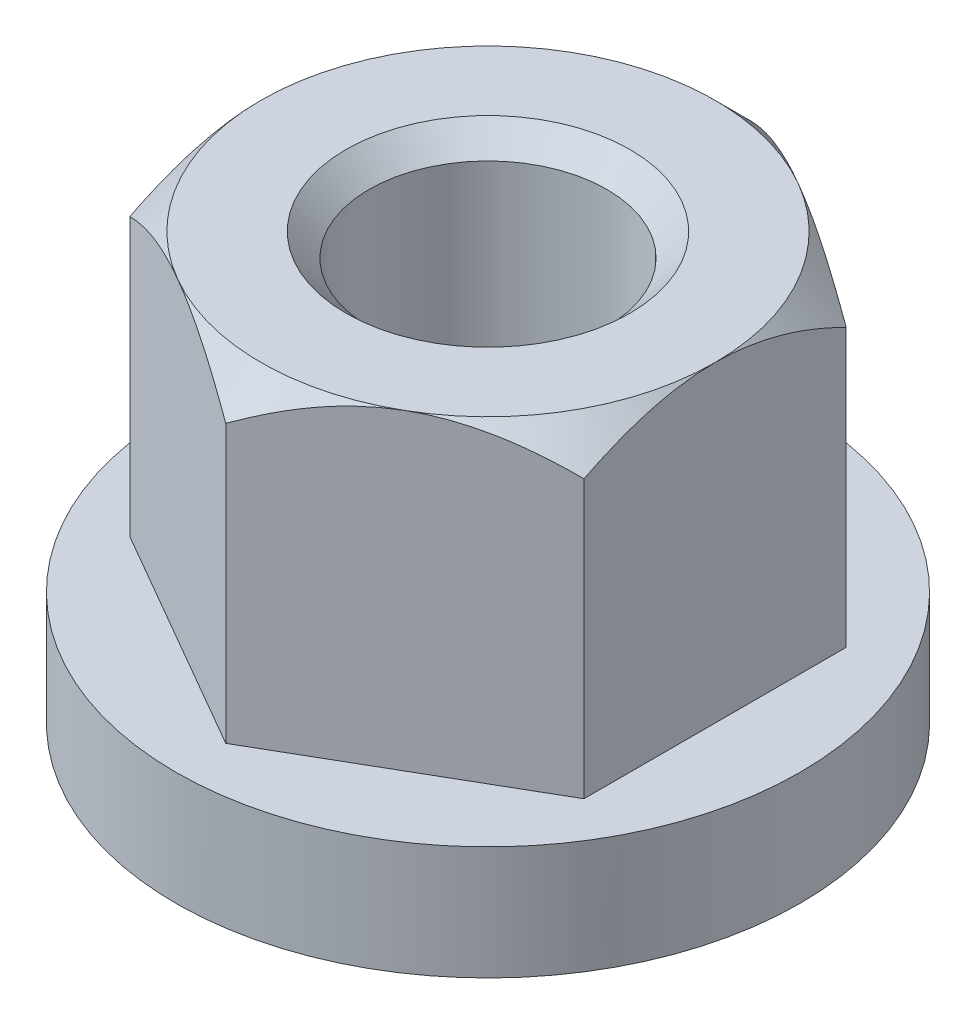
ISO-10303-21;
HEADER;
FILE_DESCRIPTION(('STEP AP214'),'2;1');
FILE_NAME('part.step','',(''),(''),'','','');
FILE_SCHEMA(('AUTOMOTIVE_DESIGN { 1 0 10303 214 1 1 1 1 }'));
ENDSEC;
DATA;
#1=APPLICATION_CONTEXT('core data for automotive mechanical design processes');
#2=APPLICATION_PROTOCOL_DEFINITION('international standard','automotive_design',2000,#1);
#3=PRODUCT_CONTEXT('',#1,'mechanical');
#4=PRODUCT('Part','Part','',(#3));
#5=PRODUCT_RELATED_PRODUCT_CATEGORY('part','',(#4));
#6=PRODUCT_DEFINITION_FORMATION('','',#4);
#7=PRODUCT_DEFINITION_CONTEXT('part definition',#1,'design');
#8=PRODUCT_DEFINITION('design','',#6,#7);
#9=PRODUCT_DEFINITION_SHAPE('','',#8);
#10=(LENGTH_UNIT() NAMED_UNIT(*) SI_UNIT(.MILLI.,.METRE.));
#11=(NAMED_UNIT(*) PLANE_ANGLE_UNIT() SI_UNIT($,.RADIAN.));
#12=(NAMED_UNIT(*) SI_UNIT($,.STERADIAN.) SOLID_ANGLE_UNIT());
#13=UNCERTAINTY_MEASURE_WITH_UNIT(LENGTH_MEASURE(1.E-05),#10,'distance_accuracy_value','');
#14=(GEOMETRIC_REPRESENTATION_CONTEXT(3) GLOBAL_UNCERTAINTY_ASSIGNED_CONTEXT((#13)) GLOBAL_UNIT_ASSIGNED_CONTEXT((#10,
#11,#12)) REPRESENTATION_CONTEXT('',''));
#15=CARTESIAN_POINT('',(0.,0.,0.));
#16=DIRECTION('',(0.,0.,1.));
#17=DIRECTION('',(1.,0.,0.));
#18=AXIS2_PLACEMENT_3D('',#15,#16,#17);
#19=CARTESIAN_POINT('',(0.,15.,0.));
#20=DIRECTION('',(0.,-1.,0.));
#21=DIRECTION('',(1.,0.,0.));
#22=AXIS2_PLACEMENT_3D('',#19,#20,#21);
#23=CONICAL_SURFACE('',#22,7.99999999999999,0.78539816339745);
#24=CARTESIAN_POINT('',(-8.,6.5868055192925,14.3315370097393));
#25=CARTESIAN_POINT('',(-8.,6.77093305006554,14.1206592095058));
#26=CARTESIAN_POINT('',(-8.,6.95451898570984,13.9093081195349));
#27=CARTESIAN_POINT('',(-8.,7.32045440727334,13.4855328768592));
#28=CARTESIAN_POINT('',(-8.,7.50280387433595,13.2731087078755));
#29=CARTESIAN_POINT('',(-8.,8.04791982845898,12.6338582382958));
#30=CARTESIAN_POINT('',(-8.,8.40859086550679,12.2052401243985));
#31=CARTESIAN_POINT('',(-8.,9.13014989063517,11.3328845099306));
#32=CARTESIAN_POINT('',(-8.,9.49088329528726,10.8890185389543));
#33=CARTESIAN_POINT('',(-8.,10.0242057501335,10.2171258279245));
#34=CARTESIAN_POINT('',(-8.,10.2006650989685,9.99217044343458));
#35=CARTESIAN_POINT('',(-8.,10.5505347549198,9.53990340491035));
#36=CARTESIAN_POINT('',(-8.,10.7239451181362,9.31259179435238));
#37=CARTESIAN_POINT('',(-8.,11.0673553287536,8.85499291242416));
#38=CARTESIAN_POINT('',(-8.,11.2373510192178,8.62470251611748));
#39=CARTESIAN_POINT('',(-8.,11.5730155603677,8.16097882762871));
#40=CARTESIAN_POINT('',(-8.,11.7386843636922,7.92754550108718));
#41=CARTESIAN_POINT('',(-8.,12.0649308199073,7.45684590769669));
#42=CARTESIAN_POINT('',(-8.,12.2255040565313,7.21957657128145));
#43=CARTESIAN_POINT('',(-8.,12.5402577485547,6.74082713773678));
#44=CARTESIAN_POINT('',(-8.,12.6944383426011,6.499347132092));
#45=CARTESIAN_POINT('',(-8.,12.993949059796,6.01311097094954));
#46=CARTESIAN_POINT('',(-8.,13.1393304116564,5.76838651460444));
#47=CARTESIAN_POINT('',(-8.,13.420476157495,5.27340322413901));
#48=CARTESIAN_POINT('',(-8.,13.5562393886212,5.02314372560309));
#49=CARTESIAN_POINT('',(-8.,13.8155534045625,4.51677785882605));
#50=CARTESIAN_POINT('',(-8.,13.9391213039601,4.26068032364055));
#51=CARTESIAN_POINT('',(-8.,14.1712202108713,3.7418118342572));
#52=CARTESIAN_POINT('',(-8.,14.2797569352965,3.47904346247025));
#53=CARTESIAN_POINT('',(-8.,14.4804667032641,2.94045170759542));
#54=CARTESIAN_POINT('',(-8.,14.5722141205094,2.6644674723679));
#55=CARTESIAN_POINT('',(-8.,14.7318671379585,2.10561666363607));
#56=CARTESIAN_POINT('',(-8.,14.7997765068194,1.82275118558422));
#57=CARTESIAN_POINT('',(-8.,14.9071542348522,1.25362839448244));
#58=CARTESIAN_POINT('',(-8.,14.9468195758615,0.96740901217864));
#59=CARTESIAN_POINT('',(-8.,14.9955042527696,0.39235716349855));
#60=CARTESIAN_POINT('',(-8.,15.004528096838,0.103525087788354));
#61=CARTESIAN_POINT('',(-8.,14.9911769025643,-0.474280210689472));
#62=CARTESIAN_POINT('',(-8.,14.9687057372736,-0.763251162830219));
#63=CARTESIAN_POINT('',(-8.,14.8939993406327,-1.33729339879283));
#64=CARTESIAN_POINT('',(-8.,14.8417576699904,-1.62236382527535));
#65=CARTESIAN_POINT('',(-8.,14.7106634607447,-2.18852279459605));
#66=CARTESIAN_POINT('',(-8.,14.6316085313001,-2.46956358530739));
#67=CARTESIAN_POINT('',(-8.,14.4514372461171,-3.0243730907397));
#68=CARTESIAN_POINT('',(-8.,14.3503199937969,-3.29814150941436));
#69=CARTESIAN_POINT('',(-8.,14.1101548598392,-3.88774787685091));
#70=CARTESIAN_POINT('',(-8.,13.9675521101733,-4.20212386771343));
#71=CARTESIAN_POINT('',(-8.,13.6632567686501,-4.82157728528354));
#72=CARTESIAN_POINT('',(-8.,13.501553437546,-5.12664935845144));
#73=CARTESIAN_POINT('',(-8.,13.1632742572121,-5.72917342200581));
#74=CARTESIAN_POINT('',(-8.,12.986669099861,-6.02660882141161));
#75=CARTESIAN_POINT('',(-8.,12.6222668930675,-6.61441532067898));
#76=CARTESIAN_POINT('',(-8.,12.4344720054252,-6.90478776990031));
#77=CARTESIAN_POINT('',(-8.,12.0490724907024,-7.48124221015028));
#78=CARTESIAN_POINT('',(-8.,11.851419436679,-7.76729167069883));
#79=CARTESIAN_POINT('',(-8.,11.4491228272956,-8.33442816011457));
#80=CARTESIAN_POINT('',(-8.,11.2444790300341,-8.61551501674863));
#81=CARTESIAN_POINT('',(-8.,10.8298351797346,-9.1732016505809));
#82=CARTESIAN_POINT('',(-8.,10.6198414897365,-9.44980617177254));
#83=CARTESIAN_POINT('',(-8.,10.1953271308729,-9.99950568261641));
#84=CARTESIAN_POINT('',(-8.,9.98080651990059,-10.2726007170785));
#85=CARTESIAN_POINT('',(-8.,9.50608508708716,-10.8684952864461));
#86=CARTESIAN_POINT('',(-8.,9.24509304681496,-11.1906637170279));
#87=CARTESIAN_POINT('',(-8.,8.7188557570093,-11.8315031374481));
#88=CARTESIAN_POINT('',(-8.,8.45361048700505,-12.1501741104406));
#89=CARTESIAN_POINT('',(-8.,7.92296483579084,-12.7806761050479));
#90=CARTESIAN_POINT('',(-8.,7.65760697605901,-13.0925429723685));
#91=CARTESIAN_POINT('',(-8.,7.12414336929001,-13.7137829913153));
#92=CARTESIAN_POINT('',(-8.,6.85603832872545,-14.0231567492447));
#93=CARTESIAN_POINT('',(-8.,6.5868055192925,-14.3315370097393));
#94=B_SPLINE_CURVE_WITH_KNOTS('',3,(#24,#25,#26,#27,#28,#29,#30,#31,#32,#33,#34,#35,#36,#37,#38,
#39,#40,#41,#42,#43,#44,#45,#46,#47,#48,#49,#50,#51,#52,#53,#54,#55,#56,#57,#58,#59,#60,#61,#62,
#63,#64,#65,#66,#67,#68,#69,#70,#71,#72,#73,#74,#75,#76,#77,#78,#79,#80,#81,#82,#83,#84,#85,#86,
#87,#88,#89,#90,#91,#92,#93),.UNSPECIFIED.,.F.,.F.,(4,2,2,2,2,2,2,2,2,2,2,2,2,2,2,2,2,2,2,2,2,2,
2,2,2,2,2,2,2,2,2,2,2,2,4),(0.,0.839851136541502,1.67971505244847,3.36018512031609,
5.07595445298282,5.93365497288164,6.79133969485436,7.65001199438802,8.50869368881368,
9.36810032224185,10.2274883066679,11.081263288829,11.9351413187407,12.7878034728174,
13.6401404320484,14.5117550680261,15.3832318446564,16.2485695302192,17.1137798963465,
17.981636757429,18.849681405252,19.7244296607525,20.5992134714132,21.633969051291,
22.6693092138637,23.7067353356315,24.7439616776454,25.7869134241359,26.829901296649,
27.8717017835153,28.9134889552166,30.1573008195122,31.4011186720745,32.6295475828863,
33.8576681430802),.UNSPECIFIED.);
#95=CARTESIAN_POINT('',(-8.,13.762395692966,4.61880215351701));
#96=VERTEX_POINT('',#95);
#97=CARTESIAN_POINT('',(-8.,15.,0.));
#98=VERTEX_POINT('',#97);
#99=EDGE_CURVE('E11',#96,#98,#94,.T.);
#100=ORIENTED_EDGE('',*,*,#99,.F.);
#101=CARTESIAN_POINT('',(0.0002,13.7622802207471,9.23771977708785));
#102=CARTESIAN_POINT('',(-0.137352811490685,13.8416874314488,9.15830362434591));
#103=CARTESIAN_POINT('',(-0.275962910531207,13.9186577191258,9.07827704635247));
#104=CARTESIAN_POINT('',(-0.555505098139322,14.0669831612369,8.91688328908706));
#105=CARTESIAN_POINT('',(-0.696438404752603,14.1383352490121,8.8355154065761));
#106=CARTESIAN_POINT('',(-1.12434348250634,14.3434607071515,8.58846429474738));
#107=CARTESIAN_POINT('',(-1.41493761977497,14.4674282426094,8.42068969137041));
#108=CARTESIAN_POINT('',(-2.00094388848254,14.6797139403575,8.08235881438528));
#109=CARTESIAN_POINT('',(-2.29620625096437,14.7685669054101,7.91188900992483));
#110=CARTESIAN_POINT('',(-2.74395385887223,14.8713478339654,7.65338180797022));
#111=CARTESIAN_POINT('',(-2.89386225006776,14.9005113127492,7.5668321579597));
#112=CARTESIAN_POINT('',(-3.19494827756707,14.9480121728763,7.39300005893374));
#113=CARTESIAN_POINT('',(-3.34612572077246,14.9663511720346,7.3057177214037));
#114=CARTESIAN_POINT('',(-3.71452735453729,14.9970993191437,7.09302093897968));
#115=CARTESIAN_POINT('',(-3.93214848793818,15.0035506548668,6.96737731902933));
#116=CARTESIAN_POINT('',(-4.36699849310612,14.9927210758661,6.7163165514885));
#117=CARTESIAN_POINT('',(-4.5842272006517,14.9754318422407,6.59089949871135));
#118=CARTESIAN_POINT('',(-5.01663658351848,14.9181402592182,6.34124782511309));
#119=CARTESIAN_POINT('',(-5.23181469458755,14.8781125110308,6.21701468476365));
#120=CARTESIAN_POINT('',(-5.65847251812678,14.777520052394,5.97068367549142));
#121=CARTESIAN_POINT('',(-5.86995251289071,14.7169569167624,5.84858564358624));
#122=CARTESIAN_POINT('',(-6.24536139742082,14.5923620564623,5.63184322304661));
#123=CARTESIAN_POINT('',(-6.41012167367212,14.5316075706723,5.53671883320116));
#124=CARTESIAN_POINT('',(-6.73668469259709,14.4003085387936,5.34817758631745));
#125=CARTESIAN_POINT('',(-6.89848734553344,14.3297636962116,5.25476078108905));
#126=CARTESIAN_POINT('',(-7.21862548473602,14.1804652228758,5.06992894024258));
#127=CARTESIAN_POINT('',(-7.37697007578074,14.1017374075223,4.97850864797819));
#128=CARTESIAN_POINT('',(-7.69072726763969,13.9371065186947,4.79736084879825));
#129=CARTESIAN_POINT('',(-7.84614159563168,13.8512078450081,4.70763234469614));
#130=CARTESIAN_POINT('',(-8.0002,13.7622802207471,4.61868668346317));
#131=B_SPLINE_CURVE_WITH_KNOTS('',3,(#101,#102,#103,#104,#105,#106,#107,#108,#109,#110,#111,
#112,#113,#114,#115,#116,#117,#118,#119,#120,#121,#122,#123,#124,#125,#126,#127,#128,#129,#130),
.UNSPECIFIED.,.F.,.F.,(4,2,2,2,2,2,2,2,2,2,2,2,2,2,4),(0.,0.53269658039059,1.06568194267353,
2.13740664213606,3.19211397028664,3.71843331125697,4.244673969182,4.99761238034705,
5.75081469500557,6.50485999129144,7.2588474744254,7.85770857481705,8.4565878152082,
9.05363199316846,9.65031250088063),.UNSPECIFIED.);
#132=CARTESIAN_POINT('',(-3.99999999999998,15.,6.9282032302755));
#133=VERTEX_POINT('',#132);
#134=EDGE_CURVE('E95',#133,#96,#131,.T.);
#135=ORIENTED_EDGE('',*,*,#134,.F.);
#136=CARTESIAN_POINT('',(0.,15.,0.));
#137=DIRECTION('',(0.,-1.,0.));
#138=DIRECTION('',(1.,0.,0.));
#139=AXIS2_PLACEMENT_3D('',#136,#137,#138);
#140=CIRCLE('',#139,7.99999999999999);
#141=EDGE_CURVE('E210',#133,#98,#140,.T.);
#142=ORIENTED_EDGE('',*,*,#141,.T.);
#143=EDGE_LOOP('',(#100,#135,#142));
#144=FACE_BOUND('',#143,.T.);
#145=ADVANCED_FACE('F17',(#144),#23,.T.);
#146=CARTESIAN_POINT('',(-8.,13.762395692966,-4.61880215351701));
#147=VERTEX_POINT('',#146);
#148=EDGE_CURVE('E21',#98,#147,#94,.T.);
#149=ORIENTED_EDGE('',*,*,#148,.F.);
#150=CARTESIAN_POINT('',(-4.,15.,-6.92820323027551));
#151=VERTEX_POINT('',#150);
#152=EDGE_CURVE('E224',#98,#151,#140,.T.);
#153=ORIENTED_EDGE('',*,*,#152,.T.);
#154=CARTESIAN_POINT('',(-8.0002,13.7622802207471,-4.61868668346317));
#155=CARTESIAN_POINT('',(-7.86264718850932,13.8416874314488,-4.69810283620511));
#156=CARTESIAN_POINT('',(-7.72403708946879,13.9186577191258,-4.77812941419855));
#157=CARTESIAN_POINT('',(-7.44449490186068,14.0669831612369,-4.93952317146396));
#158=CARTESIAN_POINT('',(-7.3035615952474,14.1383352490121,-5.02089105397492));
#159=CARTESIAN_POINT('',(-6.87565651749366,14.3434607071515,-5.26794216580365));
#160=CARTESIAN_POINT('',(-6.58506238022503,14.4674282426094,-5.43571676918061));
#161=CARTESIAN_POINT('',(-5.99905611151745,14.6797139403575,-5.77404764616574));
#162=CARTESIAN_POINT('',(-5.70379374903563,14.7685669054101,-5.94451745062619));
#163=CARTESIAN_POINT('',(-5.25604614112776,14.8713478339654,-6.20302465258081));
#164=CARTESIAN_POINT('',(-5.10613774993224,14.9005113127492,-6.28957430259132));
#165=CARTESIAN_POINT('',(-4.80505172243293,14.9480121728763,-6.46340640161729));
#166=CARTESIAN_POINT('',(-4.65387427922754,14.9663511720346,-6.55068873914732));
#167=CARTESIAN_POINT('',(-4.2854726454627,14.9970993191437,-6.76338552157135));
#168=CARTESIAN_POINT('',(-4.06785151206182,15.0035506548668,-6.8890291415217));
#169=CARTESIAN_POINT('',(-3.63300150689387,14.9927210758661,-7.14008990906252));
#170=CARTESIAN_POINT('',(-3.41577279934829,14.9754318422407,-7.26550696183968));
#171=CARTESIAN_POINT('',(-2.98336341648151,14.9181402592182,-7.51515863543793));
#172=CARTESIAN_POINT('',(-2.76818530541245,14.8781125110308,-7.63939177578737));
#173=CARTESIAN_POINT('',(-2.34152748187322,14.777520052394,-7.88572278505961));
#174=CARTESIAN_POINT('',(-2.13004748710928,14.7169569167624,-8.00782081696478));
#175=CARTESIAN_POINT('',(-1.75463860257917,14.5923620564623,-8.22456323750442));
#176=CARTESIAN_POINT('',(-1.58987832632787,14.5316075706723,-8.31968762734986));
#177=CARTESIAN_POINT('',(-1.2633153074029,14.4003085387936,-8.50822887423357));
#178=CARTESIAN_POINT('',(-1.10151265446655,14.3297636962116,-8.60164567946197));
#179=CARTESIAN_POINT('',(-0.781374515263972,14.1804652228758,-8.78647752030844));
#180=CARTESIAN_POINT('',(-0.623029924219254,14.1017374075223,-8.87789781257283));
#181=CARTESIAN_POINT('',(-0.309272732360313,13.9371065186947,-9.05904561175278));
#182=CARTESIAN_POINT('',(-0.153858404368318,13.8512078450081,-9.14877411585488));
#183=CARTESIAN_POINT('',(0.000199999999999389,13.7622802207471,-9.23771977708785));
#184=B_SPLINE_CURVE_WITH_KNOTS('',3,(#154,#155,#156,#157,#158,#159,#160,#161,#162,#163,#164,
#165,#166,#167,#168,#169,#170,#171,#172,#173,#174,#175,#176,#177,#178,#179,#180,#181,#182,#183),
.UNSPECIFIED.,.F.,.F.,(4,2,2,2,2,2,2,2,2,2,2,2,2,2,4),(0.,0.532696580390592,1.06568194267354,
2.13740664213607,3.19211397028665,3.71843331125697,4.24467396918201,4.99761238034706,
5.75081469500558,6.50485999129145,7.25884747442541,7.85770857481706,8.4565878152082,
9.05363199316846,9.65031250088063),.UNSPECIFIED.);
#185=EDGE_CURVE('E230',#147,#151,#184,.T.);
#186=ORIENTED_EDGE('',*,*,#185,.F.);
#187=EDGE_LOOP('',(#149,#153,#186));
#188=FACE_BOUND('',#187,.T.);
#189=ADVANCED_FACE('F181',(#188),#23,.T.);
#190=CARTESIAN_POINT('',(0.,13.762395692966,-9.23760430703401));
#191=VERTEX_POINT('',#190);
#192=EDGE_CURVE('E231',#151,#191,#184,.T.);
#193=ORIENTED_EDGE('',*,*,#192,.F.);
#194=CARTESIAN_POINT('',(4.00000000000001,15.,-6.92820323027551));
#195=VERTEX_POINT('',#194);
#196=EDGE_CURVE('E223',#151,#195,#140,.T.);
#197=ORIENTED_EDGE('',*,*,#196,.T.);
#198=CARTESIAN_POINT('',(-0.0002,13.7622802207471,-9.23771977708785));
#199=CARTESIAN_POINT('',(0.137352811490685,13.8416874314488,-9.15830362434591));
#200=CARTESIAN_POINT('',(0.275962910531207,13.9186577191258,-9.07827704635247));
#201=CARTESIAN_POINT('',(0.555505098139323,14.0669831612369,-8.91688328908706));
#202=CARTESIAN_POINT('',(0.696438404752604,14.1383352490121,-8.8355154065761));
#203=CARTESIAN_POINT('',(1.12434348250634,14.3434607071515,-8.58846429474738));
#204=CARTESIAN_POINT('',(1.41493761977497,14.4674282426094,-8.42068969137041));
#205=CARTESIAN_POINT('',(2.00094388848255,14.6797139403575,-8.08235881438528));
#206=CARTESIAN_POINT('',(2.29620625096437,14.7685669054101,-7.91188900992483));
#207=CARTESIAN_POINT('',(2.74395385887224,14.8713478339654,-7.65338180797021));
#208=CARTESIAN_POINT('',(2.89386225006776,14.9005113127492,-7.5668321579597));
#209=CARTESIAN_POINT('',(3.19494827756707,14.9480121728763,-7.39300005893373));
#210=CARTESIAN_POINT('',(3.34612572077246,14.9663511720346,-7.3057177214037));
#211=CARTESIAN_POINT('',(3.7145273545373,14.9970993191437,-7.09302093897967));
#212=CARTESIAN_POINT('',(3.93214848793818,15.0035506548668,-6.96737731902932));
#213=CARTESIAN_POINT('',(4.36699849310613,14.9927210758661,-6.7163165514885));
#214=CARTESIAN_POINT('',(4.58422720065171,14.9754318422407,-6.59089949871134));
#215=CARTESIAN_POINT('',(5.01663658351849,14.9181402592182,-6.34124782511309));
#216=CARTESIAN_POINT('',(5.23181469458755,14.8781125110308,-6.21701468476365));
#217=CARTESIAN_POINT('',(5.65847251812678,14.777520052394,-5.97068367549142));
#218=CARTESIAN_POINT('',(5.86995251289071,14.7169569167624,-5.84858564358624));
#219=CARTESIAN_POINT('',(6.24536139742082,14.5923620564623,-5.6318432230466));
#220=CARTESIAN_POINT('',(6.41012167367212,14.5316075706723,-5.53671883320116));
#221=CARTESIAN_POINT('',(6.7366846925971,14.4003085387936,-5.34817758631745));
#222=CARTESIAN_POINT('',(6.89848734553345,14.3297636962116,-5.25476078108905));
#223=CARTESIAN_POINT('',(7.21862548473603,14.1804652228759,-5.06992894024258));
#224=CARTESIAN_POINT('',(7.37697007578074,14.1017374075223,-4.97850864797819));
#225=CARTESIAN_POINT('',(7.69072726763969,13.9371065186947,-4.79736084879825));
#226=CARTESIAN_POINT('',(7.84614159563168,13.8512078450081,-4.70763234469614));
#227=CARTESIAN_POINT('',(8.0002,13.7622802207471,-4.61868668346317));
#228=B_SPLINE_CURVE_WITH_KNOTS('',3,(#198,#199,#200,#201,#202,#203,#204,#205,#206,#207,#208,
#209,#210,#211,#212,#213,#214,#215,#216,#217,#218,#219,#220,#221,#222,#223,#224,#225,#226,#227),
.UNSPECIFIED.,.F.,.F.,(4,2,2,2,2,2,2,2,2,2,2,2,2,2,4),(0.,0.53269658039059,1.06568194267353,
2.13740664213606,3.19211397028665,3.71843331125697,4.244673969182,4.99761238034706,
5.75081469500557,6.50485999129145,7.2588474744254,7.85770857481705,8.4565878152082,
9.05363199316846,9.65031250088063),.UNSPECIFIED.);
#229=EDGE_CURVE('E233',#191,#195,#228,.T.);
#230=ORIENTED_EDGE('',*,*,#229,.F.);
#231=EDGE_LOOP('',(#193,#197,#230));
#232=FACE_BOUND('',#231,.T.);
#233=ADVANCED_FACE('F187',(#232),#23,.T.);
#234=CARTESIAN_POINT('',(8.,13.762395692966,-4.61880215351701));
#235=VERTEX_POINT('',#234);
#236=EDGE_CURVE('E220',#195,#235,#228,.T.);
#237=ORIENTED_EDGE('',*,*,#236,.F.);
#238=CARTESIAN_POINT('',(8.,15.,0.));
#239=VERTEX_POINT('',#238);
#240=EDGE_CURVE('E136',#195,#239,#140,.T.);
#241=ORIENTED_EDGE('',*,*,#240,.T.);
#242=CARTESIAN_POINT('',(8.,6.58680551929249,-14.3315370097393));
#243=CARTESIAN_POINT('',(8.,6.77093305006554,-14.1206592095058));
#244=CARTESIAN_POINT('',(8.,6.95451898570983,-13.9093081195349));
#245=CARTESIAN_POINT('',(8.,7.32045440727334,-13.4855328768593));
#246=CARTESIAN_POINT('',(8.,7.50280387433595,-13.2731087078755));
#247=CARTESIAN_POINT('',(8.,8.04791982845897,-12.6338582382958));
#248=CARTESIAN_POINT('',(8.,8.40859086550679,-12.2052401243985));
#249=CARTESIAN_POINT('',(8.,9.13014989063517,-11.3328845099306));
#250=CARTESIAN_POINT('',(8.,9.49088329528725,-10.8890185389543));
#251=CARTESIAN_POINT('',(8.,10.0242057501335,-10.2171258279245));
#252=CARTESIAN_POINT('',(8.,10.2006650989685,-9.99217044343458));
#253=CARTESIAN_POINT('',(8.,10.5505347549198,-9.53990340491036));
#254=CARTESIAN_POINT('',(8.,10.7239451181362,-9.31259179435238));
#255=CARTESIAN_POINT('',(8.,11.0673553287536,-8.85499291242416));
#256=CARTESIAN_POINT('',(8.,11.2373510192178,-8.62470251611749));
#257=CARTESIAN_POINT('',(8.,11.5730155603677,-8.16097882762872));
#258=CARTESIAN_POINT('',(8.,11.7386843636922,-7.92754550108719));
#259=CARTESIAN_POINT('',(8.,12.0649308199073,-7.4568459076967));
#260=CARTESIAN_POINT('',(8.,12.2255040565313,-7.21957657128146));
#261=CARTESIAN_POINT('',(8.,12.5402577485547,-6.74082713773679));
#262=CARTESIAN_POINT('',(8.,12.6944383426011,-6.499347132092));
#263=CARTESIAN_POINT('',(8.,12.993949059796,-6.01311097094955));
#264=CARTESIAN_POINT('',(8.,13.1393304116564,-5.76838651460445));
#265=CARTESIAN_POINT('',(8.,13.420476157495,-5.27340322413902));
#266=CARTESIAN_POINT('',(8.,13.5562393886212,-5.0231437256031));
#267=CARTESIAN_POINT('',(8.,13.8155534045625,-4.51677785882607));
#268=CARTESIAN_POINT('',(8.,13.9391213039601,-4.26068032364056));
#269=CARTESIAN_POINT('',(8.,14.1712202108713,-3.74181183425721));
#270=CARTESIAN_POINT('',(8.,14.2797569352965,-3.47904346247026));
#271=CARTESIAN_POINT('',(8.,14.4804667032641,-2.94045170759544));
#272=CARTESIAN_POINT('',(8.,14.5722141205094,-2.66446747236792));
#273=CARTESIAN_POINT('',(8.,14.7318671379585,-2.10561666363609));
#274=CARTESIAN_POINT('',(8.,14.7997765068194,-1.82275118558424));
#275=CARTESIAN_POINT('',(8.,14.9071542348522,-1.25362839448246));
#276=CARTESIAN_POINT('',(8.,14.9468195758615,-0.96740901217866));
#277=CARTESIAN_POINT('',(8.,14.9955042527696,-0.392357163498571));
#278=CARTESIAN_POINT('',(8.,15.004528096838,-0.103525087788374));
#279=CARTESIAN_POINT('',(8.,14.9911769025643,0.474280210689453));
#280=CARTESIAN_POINT('',(8.,14.9687057372736,0.763251162830198));
#281=CARTESIAN_POINT('',(8.,14.8939993406327,1.33729339879281));
#282=CARTESIAN_POINT('',(8.,14.8417576699904,1.62236382527533));
#283=CARTESIAN_POINT('',(8.,14.7106634607447,2.18852279459603));
#284=CARTESIAN_POINT('',(8.,14.6316085313001,2.46956358530738));
#285=CARTESIAN_POINT('',(8.,14.4514372461171,3.02437309073968));
#286=CARTESIAN_POINT('',(8.,14.3503199937969,3.29814150941434));
#287=CARTESIAN_POINT('',(8.,14.1101548598393,3.88774787685089));
#288=CARTESIAN_POINT('',(8.,13.9675521101733,4.20212386771341));
#289=CARTESIAN_POINT('',(8.,13.6632567686501,4.82157728528351));
#290=CARTESIAN_POINT('',(8.,13.5015534375461,5.12664935845141));
#291=CARTESIAN_POINT('',(8.,13.1632742572122,5.72917342200579));
#292=CARTESIAN_POINT('',(8.,12.986669099861,6.02660882141158));
#293=CARTESIAN_POINT('',(8.,12.6222668930675,6.61441532067895));
#294=CARTESIAN_POINT('',(8.,12.4344720054252,6.90478776990028));
#295=CARTESIAN_POINT('',(8.,12.0490724907024,7.48124221015024));
#296=CARTESIAN_POINT('',(8.,11.851419436679,7.76729167069879));
#297=CARTESIAN_POINT('',(8.,11.4491228272957,8.33442816011453));
#298=CARTESIAN_POINT('',(8.,11.2444790300342,8.61551501674858));
#299=CARTESIAN_POINT('',(8.,10.8298351797346,9.17320165058086));
#300=CARTESIAN_POINT('',(8.,10.6198414897366,9.4498061717725));
#301=CARTESIAN_POINT('',(8.,10.195327130873,9.99950568261636));
#302=CARTESIAN_POINT('',(8.,9.98080651990063,10.2726007170784));
#303=CARTESIAN_POINT('',(8.,9.50608508708719,10.868495286446));
#304=CARTESIAN_POINT('',(8.,9.24509304681499,11.1906637170279));
#305=CARTESIAN_POINT('',(8.,8.71885575700933,11.831503137448));
#306=CARTESIAN_POINT('',(8.,8.45361048700507,12.1501741104406));
#307=CARTESIAN_POINT('',(8.,7.92296483579086,12.7806761050479));
#308=CARTESIAN_POINT('',(8.,7.65760697605902,13.0925429723685));
#309=CARTESIAN_POINT('',(8.,7.12414336929001,13.7137829913153));
#310=CARTESIAN_POINT('',(8.,6.85603832872545,14.0231567492447));
#311=CARTESIAN_POINT('',(8.,6.58680551929249,14.3315370097393));
#312=B_SPLINE_CURVE_WITH_KNOTS('',3,(#242,#243,#244,#245,#246,#247,#248,#249,#250,#251,#252,
#253,#254,#255,#256,#257,#258,#259,#260,#261,#262,#263,#264,#265,#266,#267,#268,#269,#270,#271,
#272,#273,#274,#275,#276,#277,#278,#279,#280,#281,#282,#283,#284,#285,#286,#287,#288,#289,#290,
#291,#292,#293,#294,#295,#296,#297,#298,#299,#300,#301,#302,#303,#304,#305,#306,#307,#308,#309,
#310,#311),.UNSPECIFIED.,.F.,.F.,(4,2,2,2,2,2,2,2,2,2,2,2,2,2,2,2,2,2,2,2,2,2,2,2,2,2,2,2,2,2,2,
2,2,2,4),(0.,0.839851136541501,1.67971505244846,3.36018512031609,5.07595445298281,
5.93365497288163,6.79133969485435,7.650011994388,8.50869368881368,9.36810032224184,
10.2274883066679,11.081263288829,11.9351413187407,12.7878034728174,13.6401404320484,
14.5117550680261,15.3832318446564,16.2485695302192,17.1137798963465,17.981636757429,
18.849681405252,19.7244296607525,20.5992134714132,21.633969051291,22.6693092138637,
23.7067353356315,24.7439616776453,25.7869134241359,26.829901296649,27.8717017835153,
28.9134889552165,30.1573008195121,31.4011186720744,32.6295475828863,33.8576681430802),.UNSPECIFIED.);
#313=EDGE_CURVE('E216',#235,#239,#312,.T.);
#314=ORIENTED_EDGE('',*,*,#313,.F.);
#315=EDGE_LOOP('',(#237,#241,#314));
#316=FACE_BOUND('',#315,.T.);
#317=ADVANCED_FACE('F197',(#316),#23,.T.);
#318=CARTESIAN_POINT('',(8.,13.762395692966,4.61880215351701));
#319=VERTEX_POINT('',#318);
#320=EDGE_CURVE('E213',#239,#319,#312,.T.);
#321=ORIENTED_EDGE('',*,*,#320,.F.);
#322=CARTESIAN_POINT('',(4.,15.,6.92820323027551));
#323=VERTEX_POINT('',#322);
#324=EDGE_CURVE('E137',#239,#323,#140,.T.);
#325=ORIENTED_EDGE('',*,*,#324,.T.);
#326=CARTESIAN_POINT('',(8.0002,13.7622802207471,4.61868668346317));
#327=CARTESIAN_POINT('',(7.86264718850931,13.8416874314488,4.69810283620511));
#328=CARTESIAN_POINT('',(7.72403708946879,13.9186577191258,4.77812941419855));
#329=CARTESIAN_POINT('',(7.44449490186068,14.0669831612369,4.93952317146396));
#330=CARTESIAN_POINT('',(7.3035615952474,14.1383352490121,5.02089105397492));
#331=CARTESIAN_POINT('',(6.87565651749366,14.3434607071515,5.26794216580364));
#332=CARTESIAN_POINT('',(6.58506238022504,14.4674282426094,5.43571676918061));
#333=CARTESIAN_POINT('',(5.99905611151746,14.6797139403575,5.77404764616574));
#334=CARTESIAN_POINT('',(5.70379374903564,14.7685669054101,5.94451745062619));
#335=CARTESIAN_POINT('',(5.25604614112777,14.8713478339654,6.2030246525808));
#336=CARTESIAN_POINT('',(5.10613774993225,14.9005113127492,6.28957430259132));
#337=CARTESIAN_POINT('',(4.80505172243294,14.9480121728763,6.46340640161728));
#338=CARTESIAN_POINT('',(4.65387427922755,14.9663511720346,6.55068873914731));
#339=CARTESIAN_POINT('',(4.28547264546271,14.9970993191437,6.76338552157134));
#340=CARTESIAN_POINT('',(4.06785151206183,15.0035506548668,6.88902914152169));
#341=CARTESIAN_POINT('',(3.63300150689388,14.9927210758661,7.14008990906252));
#342=CARTESIAN_POINT('',(3.4157727993483,14.9754318422407,7.26550696183967));
#343=CARTESIAN_POINT('',(2.98336341648152,14.9181402592182,7.51515863543793));
#344=CARTESIAN_POINT('',(2.76818530541246,14.8781125110308,7.63939177578736));
#345=CARTESIAN_POINT('',(2.34152748187323,14.777520052394,7.8857227850596));
#346=CARTESIAN_POINT('',(2.1300474871093,14.7169569167624,8.00782081696477));
#347=CARTESIAN_POINT('',(1.75463860257918,14.5923620564623,8.22456323750441));
#348=CARTESIAN_POINT('',(1.58987832632788,14.5316075706723,8.31968762734986));
#349=CARTESIAN_POINT('',(1.26331530740291,14.4003085387936,8.50822887423357));
#350=CARTESIAN_POINT('',(1.10151265446655,14.3297636962116,8.60164567946197));
#351=CARTESIAN_POINT('',(0.781374515263974,14.1804652228758,8.78647752030844));
#352=CARTESIAN_POINT('',(0.623029924219256,14.1017374075223,8.87789781257283));
#353=CARTESIAN_POINT('',(0.309272732360314,13.9371065186947,9.05904561175278));
#354=CARTESIAN_POINT('',(0.153858404368318,13.8512078450081,9.14877411585488));
#355=CARTESIAN_POINT('',(-0.000200000000000548,13.7622802207471,9.23771977708785));
#356=B_SPLINE_CURVE_WITH_KNOTS('',3,(#326,#327,#328,#329,#330,#331,#332,#333,#334,#335,#336,
#337,#338,#339,#340,#341,#342,#343,#344,#345,#346,#347,#348,#349,#350,#351,#352,#353,#354,#355),
.UNSPECIFIED.,.F.,.F.,(4,2,2,2,2,2,2,2,2,2,2,2,2,2,4),(0.,0.53269658039059,1.06568194267353,
2.13740664213606,3.19211397028664,3.71843331125696,4.24467396918199,4.99761238034705,
5.75081469500556,6.50485999129144,7.2588474744254,7.85770857481705,8.4565878152082,
9.05363199316846,9.65031250088063),.UNSPECIFIED.);
#357=EDGE_CURVE('E203',#319,#323,#356,.T.);
#358=ORIENTED_EDGE('',*,*,#357,.F.);
#359=EDGE_LOOP('',(#321,#325,#358));
#360=FACE_BOUND('',#359,.T.);
#361=ADVANCED_FACE('F190',(#360),#23,.T.);
#362=CARTESIAN_POINT('',(0.,13.762395692966,9.23760430703401));
#363=VERTEX_POINT('',#362);
#364=EDGE_CURVE('E149',#323,#363,#356,.T.);
#365=ORIENTED_EDGE('',*,*,#364,.F.);
#366=EDGE_CURVE('E140',#323,#133,#140,.T.);
#367=ORIENTED_EDGE('',*,*,#366,.T.);
#368=EDGE_CURVE('E37',#363,#133,#131,.T.);
#369=ORIENTED_EDGE('',*,*,#368,.F.);
#370=EDGE_LOOP('',(#365,#367,#369));
#371=FACE_BOUND('',#370,.T.);
#372=ADVANCED_FACE('F183',(#371),#23,.T.);
#373=CARTESIAN_POINT('',(0.,15.,0.));
#374=DIRECTION('',(0.,-1.,0.));
#375=DIRECTION('',(1.,0.,0.));
#376=AXIS2_PLACEMENT_3D('',#373,#374,#375);
#377=PLANE('',#376);
#378=ORIENTED_EDGE('',*,*,#324,.F.);
#379=ORIENTED_EDGE('',*,*,#240,.F.);
#380=ORIENTED_EDGE('',*,*,#196,.F.);
#381=ORIENTED_EDGE('',*,*,#152,.F.);
#382=ORIENTED_EDGE('',*,*,#141,.F.);
#383=ORIENTED_EDGE('',*,*,#366,.F.);
#384=EDGE_LOOP('',(#378,#379,#380,#381,#382,#383));
#385=FACE_BOUND('',#384,.T.);
#386=CARTESIAN_POINT('',(0.,15.,0.));
#387=DIRECTION('',(0.,-1.,0.));
#388=DIRECTION('',(0.,0.,-1.));
#389=AXIS2_PLACEMENT_3D('',#386,#387,#388);
#390=CIRCLE('',#389,5.);
#391=CARTESIAN_POINT('',(0.,15.,-5.));
#392=VERTEX_POINT('',#391);
#393=EDGE_CURVE('E110',#392,#392,#390,.T.);
#394=ORIENTED_EDGE('',*,*,#393,.T.);
#395=EDGE_LOOP('',(#394));
#396=FACE_BOUND('',#395,.T.);
#397=ADVANCED_FACE('F19',(#385,#396),#377,.F.);
#398=CARTESIAN_POINT('',(-8.,4.,-4.61880215351701));
#399=DIRECTION('',(-1.,0.,0.));
#400=DIRECTION('',(0.,0.,1.));
#401=AXIS2_PLACEMENT_3D('',#398,#399,#400);
#402=PLANE('',#401);
#403=ORIENTED_EDGE('',*,*,#99,.T.);
#404=ORIENTED_EDGE('',*,*,#148,.T.);
#405=DIRECTION('',(0.,1.,0.));
#406=VECTOR('',#405,1.);
#407=CARTESIAN_POINT('',(-8.,4.,-4.61880215351701));
#408=LINE('',#407,#406);
#409=CARTESIAN_POINT('',(-8.,4.,-4.61880215351701));
#410=VERTEX_POINT('',#409);
#411=EDGE_CURVE('E113',#410,#147,#408,.T.);
#412=ORIENTED_EDGE('',*,*,#411,.F.);
#413=DIRECTION('',(0.,0.,1.));
#414=VECTOR('',#413,1.);
#415=CARTESIAN_POINT('',(-8.,4.,-4.61880215351701));
#416=LINE('',#415,#414);
#417=CARTESIAN_POINT('',(-8.,4.,4.61880215351701));
#418=VERTEX_POINT('',#417);
#419=EDGE_CURVE('E99',#410,#418,#416,.T.);
#420=ORIENTED_EDGE('',*,*,#419,.T.);
#421=DIRECTION('',(0.,1.,0.));
#422=VECTOR('',#421,1.);
#423=CARTESIAN_POINT('',(-8.,4.,4.61880215351701));
#424=LINE('',#423,#422);
#425=EDGE_CURVE('E91',#418,#96,#424,.T.);
#426=ORIENTED_EDGE('',*,*,#425,.T.);
#427=EDGE_LOOP('',(#403,#404,#412,#420,#426));
#428=FACE_BOUND('',#427,.T.);
#429=ADVANCED_FACE('F112',(#428),#402,.T.);
#430=CARTESIAN_POINT('',(0.,4.,-9.23760430703401));
#431=DIRECTION('',(-0.5,0.,-0.866025403784439));
#432=DIRECTION('',(-0.866025403784439,0.,0.5));
#433=AXIS2_PLACEMENT_3D('',#430,#431,#432);
#434=PLANE('',#433);
#435=ORIENTED_EDGE('',*,*,#185,.T.);
#436=ORIENTED_EDGE('',*,*,#192,.T.);
#437=DIRECTION('',(0.,1.,0.));
#438=VECTOR('',#437,1.);
#439=CARTESIAN_POINT('',(0.,4.,-9.23760430703401));
#440=LINE('',#439,#438);
#441=CARTESIAN_POINT('',(0.,4.,-9.23760430703401));
#442=VERTEX_POINT('',#441);
#443=EDGE_CURVE('E123',#442,#191,#440,.T.);
#444=ORIENTED_EDGE('',*,*,#443,.F.);
#445=DIRECTION('',(-0.866025403784439,0.,0.5));
#446=VECTOR('',#445,1.);
#447=CARTESIAN_POINT('',(0.,4.,-9.23760430703401));
#448=LINE('',#447,#446);
#449=EDGE_CURVE('E115',#442,#410,#448,.T.);
#450=ORIENTED_EDGE('',*,*,#449,.T.);
#451=ORIENTED_EDGE('',*,*,#411,.T.);
#452=EDGE_LOOP('',(#435,#436,#444,#450,#451));
#453=FACE_BOUND('',#452,.T.);
#454=ADVANCED_FACE('F245',(#453),#434,.T.);
#455=CARTESIAN_POINT('',(8.,4.,-4.61880215351701));
#456=DIRECTION('',(0.5,0.,-0.866025403784439));
#457=DIRECTION('',(-0.866025403784439,0.,-0.5));
#458=AXIS2_PLACEMENT_3D('',#455,#456,#457);
#459=PLANE('',#458);
#460=ORIENTED_EDGE('',*,*,#229,.T.);
#461=ORIENTED_EDGE('',*,*,#236,.T.);
#462=DIRECTION('',(0.,1.,0.));
#463=VECTOR('',#462,1.);
#464=CARTESIAN_POINT('',(8.,4.,-4.61880215351701));
#465=LINE('',#464,#463);
#466=CARTESIAN_POINT('',(8.,4.,-4.61880215351701));
#467=VERTEX_POINT('',#466);
#468=EDGE_CURVE('E126',#467,#235,#465,.T.);
#469=ORIENTED_EDGE('',*,*,#468,.F.);
#470=DIRECTION('',(-0.866025403784439,0.,-0.5));
#471=VECTOR('',#470,1.);
#472=CARTESIAN_POINT('',(8.,4.,-4.61880215351701));
#473=LINE('',#472,#471);
#474=EDGE_CURVE('E117',#467,#442,#473,.T.);
#475=ORIENTED_EDGE('',*,*,#474,.T.);
#476=ORIENTED_EDGE('',*,*,#443,.T.);
#477=EDGE_LOOP('',(#460,#461,#469,#475,#476));
#478=FACE_BOUND('',#477,.T.);
#479=ADVANCED_FACE('F248',(#478),#459,.T.);
#480=CARTESIAN_POINT('',(8.,4.,4.61880215351701));
#481=DIRECTION('',(1.,0.,0.));
#482=DIRECTION('',(0.,0.,-1.));
#483=AXIS2_PLACEMENT_3D('',#480,#481,#482);
#484=PLANE('',#483);
#485=ORIENTED_EDGE('',*,*,#313,.T.);
#486=ORIENTED_EDGE('',*,*,#320,.T.);
#487=DIRECTION('',(0.,1.,0.));
#488=VECTOR('',#487,1.);
#489=CARTESIAN_POINT('',(8.,4.,4.61880215351701));
#490=LINE('',#489,#488);
#491=CARTESIAN_POINT('',(8.,4.,4.61880215351701));
#492=VERTEX_POINT('',#491);
#493=EDGE_CURVE('E129',#492,#319,#490,.T.);
#494=ORIENTED_EDGE('',*,*,#493,.F.);
#495=DIRECTION('',(0.,0.,-1.));
#496=VECTOR('',#495,1.);
#497=CARTESIAN_POINT('',(8.,4.,4.61880215351701));
#498=LINE('',#497,#496);
#499=EDGE_CURVE('E267',#492,#467,#498,.T.);
#500=ORIENTED_EDGE('',*,*,#499,.T.);
#501=ORIENTED_EDGE('',*,*,#468,.T.);
#502=EDGE_LOOP('',(#485,#486,#494,#500,#501));
#503=FACE_BOUND('',#502,.T.);
#504=ADVANCED_FACE('F253',(#503),#484,.T.);
#505=CARTESIAN_POINT('',(0.,4.,9.23760430703401));
#506=DIRECTION('',(0.5,0.,0.866025403784439));
#507=DIRECTION('',(0.866025403784439,0.,-0.5));
#508=AXIS2_PLACEMENT_3D('',#505,#506,#507);
#509=PLANE('',#508);
#510=ORIENTED_EDGE('',*,*,#357,.T.);
#511=ORIENTED_EDGE('',*,*,#364,.T.);
#512=DIRECTION('',(0.,1.,0.));
#513=VECTOR('',#512,1.);
#514=CARTESIAN_POINT('',(0.,4.,9.23760430703401));
#515=LINE('',#514,#513);
#516=CARTESIAN_POINT('',(0.,4.,9.23760430703401));
#517=VERTEX_POINT('',#516);
#518=EDGE_CURVE('E98',#517,#363,#515,.T.);
#519=ORIENTED_EDGE('',*,*,#518,.F.);
#520=DIRECTION('',(0.866025403784439,0.,-0.5));
#521=VECTOR('',#520,1.);
#522=CARTESIAN_POINT('',(0.,4.,9.23760430703401));
#523=LINE('',#522,#521);
#524=EDGE_CURVE('E109',#517,#492,#523,.T.);
#525=ORIENTED_EDGE('',*,*,#524,.T.);
#526=ORIENTED_EDGE('',*,*,#493,.T.);
#527=EDGE_LOOP('',(#510,#511,#519,#525,#526));
#528=FACE_BOUND('',#527,.T.);
#529=ADVANCED_FACE('F161',(#528),#509,.T.);
#530=CARTESIAN_POINT('',(-8.,4.,4.61880215351701));
#531=DIRECTION('',(-0.5,0.,0.866025403784439));
#532=DIRECTION('',(0.866025403784439,0.,0.5));
#533=AXIS2_PLACEMENT_3D('',#530,#531,#532);
#534=PLANE('',#533);
#535=ORIENTED_EDGE('',*,*,#368,.T.);
#536=ORIENTED_EDGE('',*,*,#134,.T.);
#537=ORIENTED_EDGE('',*,*,#425,.F.);
#538=DIRECTION('',(0.866025403784439,0.,0.5));
#539=VECTOR('',#538,1.);
#540=CARTESIAN_POINT('',(-8.,4.,4.61880215351701));
#541=LINE('',#540,#539);
#542=EDGE_CURVE('E94',#418,#517,#541,.T.);
#543=ORIENTED_EDGE('',*,*,#542,.T.);
#544=ORIENTED_EDGE('',*,*,#518,.T.);
#545=EDGE_LOOP('',(#535,#536,#537,#543,#544));
#546=FACE_BOUND('',#545,.T.);
#547=ADVANCED_FACE('F93',(#546),#534,.T.);
#548=CARTESIAN_POINT('',(0.,4.,0.));
#549=DIRECTION('',(0.,1.,0.));
#550=DIRECTION('',(0.,0.,1.));
#551=AXIS2_PLACEMENT_3D('',#548,#549,#550);
#552=PLANE('',#551);
#553=ORIENTED_EDGE('',*,*,#419,.F.);
#554=ORIENTED_EDGE('',*,*,#449,.F.);
#555=ORIENTED_EDGE('',*,*,#474,.F.);
#556=ORIENTED_EDGE('',*,*,#499,.F.);
#557=ORIENTED_EDGE('',*,*,#524,.F.);
#558=ORIENTED_EDGE('',*,*,#542,.F.);
#559=EDGE_LOOP('',(#553,#554,#555,#556,#557,#558));
#560=FACE_BOUND('',#559,.T.);
#561=CARTESIAN_POINT('',(0.,4.,0.));
#562=DIRECTION('',(0.,1.,0.));
#563=DIRECTION('',(0.,0.,1.));
#564=AXIS2_PLACEMENT_3D('',#561,#562,#563);
#565=CIRCLE('',#564,11.);
#566=CARTESIAN_POINT('',(0.,4.,11.));
#567=VERTEX_POINT('',#566);
#568=EDGE_CURVE('E122',#567,#567,#565,.T.);
#569=ORIENTED_EDGE('',*,*,#568,.T.);
#570=EDGE_LOOP('',(#569));
#571=FACE_BOUND('',#570,.T.);
#572=ADVANCED_FACE('F104',(#560,#571),#552,.T.);
#573=CARTESIAN_POINT('',(11.,0.,0.));
#574=DIRECTION('',(0.,1.,0.));
#575=DIRECTION('',(-1.,0.,0.));
#576=AXIS2_PLACEMENT_3D('',#573,#574,#575);
#577=PLANE('',#576);
#578=CARTESIAN_POINT('',(0.,0.,0.));
#579=DIRECTION('',(0.,-1.,0.));
#580=DIRECTION('',(0.,0.,-1.));
#581=AXIS2_PLACEMENT_3D('',#578,#579,#580);
#582=CIRCLE('',#581,5.);
#583=CARTESIAN_POINT('',(0.,0.,-5.));
#584=VERTEX_POINT('',#583);
#585=EDGE_CURVE('E279',#584,#584,#582,.T.);
#586=ORIENTED_EDGE('',*,*,#585,.F.);
#587=EDGE_LOOP('',(#586));
#588=FACE_BOUND('',#587,.T.);
#589=CARTESIAN_POINT('',(0.,0.,0.));
#590=DIRECTION('',(0.,-1.,0.));
#591=DIRECTION('',(1.,0.,0.));
#592=AXIS2_PLACEMENT_3D('',#589,#590,#591);
#593=CIRCLE('',#592,11.);
#594=CARTESIAN_POINT('',(11.,0.,0.));
#595=VERTEX_POINT('',#594);
#596=EDGE_CURVE('E133',#595,#595,#593,.T.);
#597=ORIENTED_EDGE('',*,*,#596,.T.);
#598=EDGE_LOOP('',(#597));
#599=FACE_BOUND('',#598,.T.);
#600=ADVANCED_FACE('F164',(#588,#599),#577,.F.);
#601=CARTESIAN_POINT('',(0.,0.,0.));
#602=DIRECTION('',(0.,-1.,0.));
#603=DIRECTION('',(1.,0.,0.));
#604=AXIS2_PLACEMENT_3D('',#601,#602,#603);
#605=CYLINDRICAL_SURFACE('',#604,11.);
#606=ORIENTED_EDGE('',*,*,#596,.F.);
#607=EDGE_LOOP('',(#606));
#608=FACE_BOUND('',#607,.T.);
#609=ORIENTED_EDGE('',*,*,#568,.F.);
#610=EDGE_LOOP('',(#609));
#611=FACE_BOUND('',#610,.T.);
#612=ADVANCED_FACE('F166',(#608,#611),#605,.T.);
#613=CARTESIAN_POINT('',(0.,15.,0.));
#614=DIRECTION('',(0.,1.,0.));
#615=DIRECTION('',(0.,0.,1.));
#616=AXIS2_PLACEMENT_3D('',#613,#614,#615);
#617=CONICAL_SURFACE('',#616,5.,0.785398163397448);
#618=CARTESIAN_POINT('',(0.,14.188,0.));
#619=DIRECTION('',(0.,-1.,0.));
#620=DIRECTION('',(0.,0.,-1.));
#621=AXIS2_PLACEMENT_3D('',#618,#619,#620);
#622=CIRCLE('',#621,4.188);
#623=CARTESIAN_POINT('',(0.,14.188,-4.188));
#624=VERTEX_POINT('',#623);
#625=EDGE_CURVE('E273',#624,#624,#622,.T.);
#626=ORIENTED_EDGE('',*,*,#625,.T.);
#627=EDGE_LOOP('',(#626));
#628=FACE_BOUND('',#627,.T.);
#629=ORIENTED_EDGE('',*,*,#393,.F.);
#630=EDGE_LOOP('',(#629));
#631=FACE_BOUND('',#630,.T.);
#632=ADVANCED_FACE('F169',(#628,#631),#617,.F.);
#633=CARTESIAN_POINT('',(0.,0.,0.));
#634=DIRECTION('',(0.,-1.,0.));
#635=DIRECTION('',(0.,0.,-1.));
#636=AXIS2_PLACEMENT_3D('',#633,#634,#635);
#637=CYLINDRICAL_SURFACE('',#636,4.188);
#638=CARTESIAN_POINT('',(0.,0.812000000000002,0.));
#639=DIRECTION('',(0.,-1.,0.));
#640=DIRECTION('',(0.,0.,-1.));
#641=AXIS2_PLACEMENT_3D('',#638,#639,#640);
#642=CIRCLE('',#641,4.188);
#643=CARTESIAN_POINT('',(0.,0.812000000000002,-4.188));
#644=VERTEX_POINT('',#643);
#645=EDGE_CURVE('E276',#644,#644,#642,.T.);
#646=ORIENTED_EDGE('',*,*,#645,.T.);
#647=EDGE_LOOP('',(#646));
#648=FACE_BOUND('',#647,.T.);
#649=ORIENTED_EDGE('',*,*,#625,.F.);
#650=EDGE_LOOP('',(#649));
#651=FACE_BOUND('',#650,.T.);
#652=ADVANCED_FACE('F175',(#648,#651),#637,.F.);
#653=CARTESIAN_POINT('',(0.,0.812000000000002,0.));
#654=DIRECTION('',(0.,-1.,0.));
#655=DIRECTION('',(0.,0.,-1.));
#656=AXIS2_PLACEMENT_3D('',#653,#654,#655);
#657=CONICAL_SURFACE('',#656,4.188,0.785398163397447);
#658=ORIENTED_EDGE('',*,*,#585,.T.);
#659=EDGE_LOOP('',(#658));
#660=FACE_BOUND('',#659,.T.);
#661=ORIENTED_EDGE('',*,*,#645,.F.);
#662=EDGE_LOOP('',(#661));
#663=FACE_BOUND('',#662,.T.);
#664=ADVANCED_FACE('F283',(#660,#663),#657,.F.);
#665=CLOSED_SHELL('',(#145,#189,#233,#317,#361,#372,#397,#429,#454,#479,#504,#529,#547,#572,
#600,#612,#632,#652,#664));
#666=MANIFOLD_SOLID_BREP('B1',#665);
#667=ADVANCED_BREP_SHAPE_REPRESENTATION('',(#18,#666),#14);
#668=SHAPE_DEFINITION_REPRESENTATION(#9,#667);
ENDSEC;
END-ISO-10303-21;
